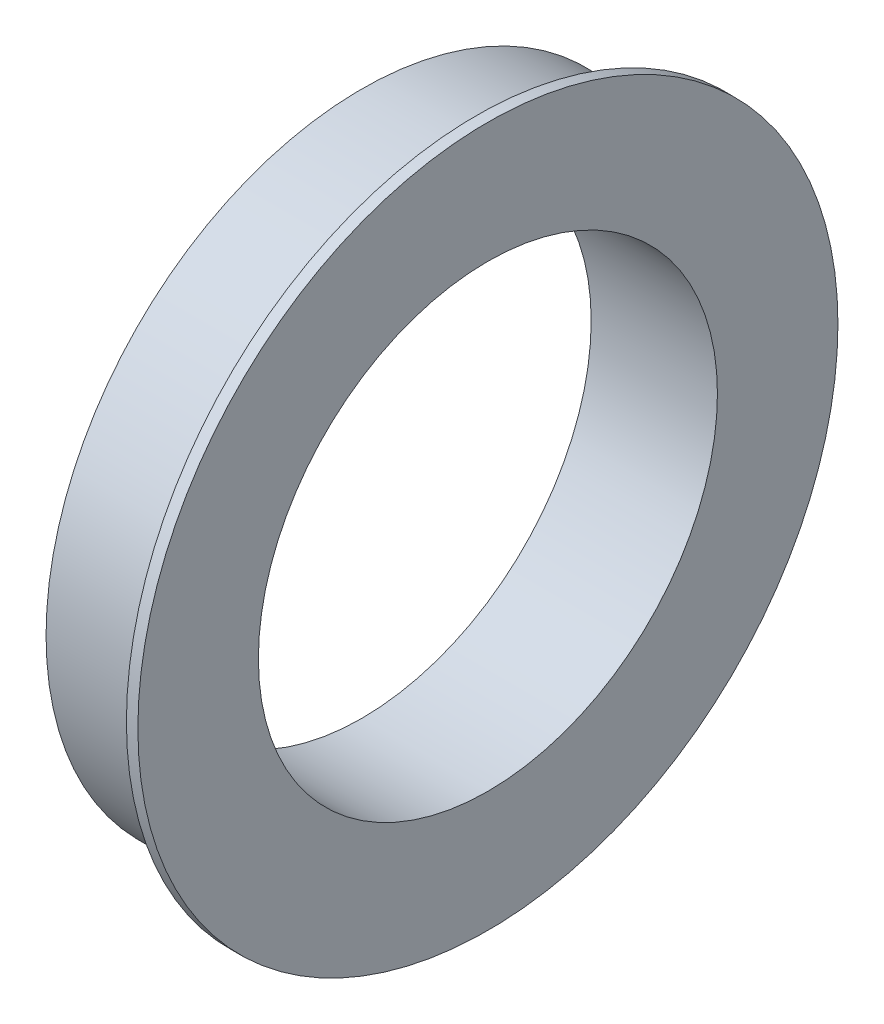
ISO-10303-21;
HEADER;
FILE_DESCRIPTION(('STEP AP214'),'2;1');
FILE_NAME('part.step','',(''),(''),'','','');
FILE_SCHEMA(('AUTOMOTIVE_DESIGN { 1 0 10303 214 1 1 1 1 }'));
ENDSEC;
DATA;
#1=APPLICATION_CONTEXT('core data for automotive mechanical design processes');
#2=APPLICATION_PROTOCOL_DEFINITION('international standard','automotive_design',2000,#1);
#3=PRODUCT_CONTEXT('',#1,'mechanical');
#4=PRODUCT('Part','Part','',(#3));
#5=PRODUCT_RELATED_PRODUCT_CATEGORY('part','',(#4));
#6=PRODUCT_DEFINITION_FORMATION('','',#4);
#7=PRODUCT_DEFINITION_CONTEXT('part definition',#1,'design');
#8=PRODUCT_DEFINITION('design','',#6,#7);
#9=PRODUCT_DEFINITION_SHAPE('','',#8);
#10=(LENGTH_UNIT() NAMED_UNIT(*) SI_UNIT(.MILLI.,.METRE.));
#11=(NAMED_UNIT(*) PLANE_ANGLE_UNIT() SI_UNIT($,.RADIAN.));
#12=(NAMED_UNIT(*) SI_UNIT($,.STERADIAN.) SOLID_ANGLE_UNIT());
#13=UNCERTAINTY_MEASURE_WITH_UNIT(LENGTH_MEASURE(1.E-05),#10,'distance_accuracy_value','');
#14=(GEOMETRIC_REPRESENTATION_CONTEXT(3) GLOBAL_UNCERTAINTY_ASSIGNED_CONTEXT((#13)) GLOBAL_UNIT_ASSIGNED_CONTEXT((#10,
#11,#12)) REPRESENTATION_CONTEXT('',''));
#15=CARTESIAN_POINT('',(0.,0.,0.));
#16=DIRECTION('',(0.,0.,1.));
#17=DIRECTION('',(1.,0.,0.));
#18=AXIS2_PLACEMENT_3D('',#15,#16,#17);
#19=CARTESIAN_POINT('',(0.,40.,0.));
#20=DIRECTION('',(1.,0.,0.));
#21=DIRECTION('',(0.,0.,-1.));
#22=AXIS2_PLACEMENT_3D('',#19,#20,#21);
#23=PLANE('',#22);
#24=CARTESIAN_POINT('',(0.,0.,0.));
#25=DIRECTION('',(-1.,0.,0.));
#26=DIRECTION('',(0.,0.,1.));
#27=AXIS2_PLACEMENT_3D('',#24,#25,#26);
#28=CIRCLE('',#27,40.);
#29=CARTESIAN_POINT('',(0.,0.,40.));
#30=VERTEX_POINT('',#29);
#31=EDGE_CURVE('E10',#30,#30,#28,.T.);
#32=ORIENTED_EDGE('',*,*,#31,.F.);
#33=EDGE_LOOP('',(#32));
#34=FACE_BOUND('',#33,.T.);
#35=CARTESIAN_POINT('',(0.,0.,0.));
#36=DIRECTION('',(-1.,0.,0.));
#37=DIRECTION('',(0.,0.,1.));
#38=AXIS2_PLACEMENT_3D('',#35,#36,#37);
#39=CIRCLE('',#38,55.);
#40=CARTESIAN_POINT('',(0.,0.,55.));
#41=VERTEX_POINT('',#40);
#42=EDGE_CURVE('E54',#41,#41,#39,.T.);
#43=ORIENTED_EDGE('',*,*,#42,.T.);
#44=EDGE_LOOP('',(#43));
#45=FACE_BOUND('',#44,.T.);
#46=ADVANCED_FACE('F32',(#34,#45),#23,.F.);
#47=CARTESIAN_POINT('',(0.,0.,0.));
#48=DIRECTION('',(-1.,0.,0.));
#49=DIRECTION('',(0.,0.,1.));
#50=AXIS2_PLACEMENT_3D('',#47,#48,#49);
#51=CYLINDRICAL_SURFACE('',#50,40.);
#52=CARTESIAN_POINT('',(22.,0.,0.));
#53=DIRECTION('',(-1.,0.,0.));
#54=DIRECTION('',(0.,0.,1.));
#55=AXIS2_PLACEMENT_3D('',#52,#53,#54);
#56=CIRCLE('',#55,40.);
#57=CARTESIAN_POINT('',(22.,0.,40.));
#58=VERTEX_POINT('',#57);
#59=EDGE_CURVE('E38',#58,#58,#56,.T.);
#60=ORIENTED_EDGE('',*,*,#59,.F.);
#61=EDGE_LOOP('',(#60));
#62=FACE_BOUND('',#61,.T.);
#63=ORIENTED_EDGE('',*,*,#31,.T.);
#64=EDGE_LOOP('',(#63));
#65=FACE_BOUND('',#64,.T.);
#66=ADVANCED_FACE('F79',(#62,#65),#51,.F.);
#67=CARTESIAN_POINT('',(22.,40.,0.));
#68=DIRECTION('',(-1.,0.,0.));
#69=DIRECTION('',(0.,0.,1.));
#70=AXIS2_PLACEMENT_3D('',#67,#68,#69);
#71=PLANE('',#70);
#72=CARTESIAN_POINT('',(22.,0.,0.));
#73=DIRECTION('',(-1.,0.,0.));
#74=DIRECTION('',(0.,0.,1.));
#75=AXIS2_PLACEMENT_3D('',#72,#73,#74);
#76=CIRCLE('',#75,61.);
#77=CARTESIAN_POINT('',(22.,0.,61.));
#78=VERTEX_POINT('',#77);
#79=EDGE_CURVE('E42',#78,#78,#76,.T.);
#80=ORIENTED_EDGE('',*,*,#79,.F.);
#81=EDGE_LOOP('',(#80));
#82=FACE_BOUND('',#81,.T.);
#83=ORIENTED_EDGE('',*,*,#59,.T.);
#84=EDGE_LOOP('',(#83));
#85=FACE_BOUND('',#84,.T.);
#86=ADVANCED_FACE('F74',(#82,#85),#71,.F.);
#87=CARTESIAN_POINT('',(0.,0.,0.));
#88=DIRECTION('',(-1.,0.,0.));
#89=DIRECTION('',(0.,0.,1.));
#90=AXIS2_PLACEMENT_3D('',#87,#88,#89);
#91=CYLINDRICAL_SURFACE('',#90,61.);
#92=CARTESIAN_POINT('',(20.,0.,0.));
#93=DIRECTION('',(-1.,0.,0.));
#94=DIRECTION('',(0.,0.,1.));
#95=AXIS2_PLACEMENT_3D('',#92,#93,#94);
#96=CIRCLE('',#95,61.);
#97=CARTESIAN_POINT('',(20.,0.,61.));
#98=VERTEX_POINT('',#97);
#99=EDGE_CURVE('E46',#98,#98,#96,.T.);
#100=ORIENTED_EDGE('',*,*,#99,.F.);
#101=EDGE_LOOP('',(#100));
#102=FACE_BOUND('',#101,.T.);
#103=ORIENTED_EDGE('',*,*,#79,.T.);
#104=EDGE_LOOP('',(#103));
#105=FACE_BOUND('',#104,.T.);
#106=ADVANCED_FACE('F68',(#102,#105),#91,.T.);
#107=CARTESIAN_POINT('',(20.,61.,0.));
#108=DIRECTION('',(1.,0.,0.));
#109=DIRECTION('',(0.,0.,-1.));
#110=AXIS2_PLACEMENT_3D('',#107,#108,#109);
#111=PLANE('',#110);
#112=CARTESIAN_POINT('',(20.,0.,0.));
#113=DIRECTION('',(-1.,0.,0.));
#114=DIRECTION('',(0.,0.,1.));
#115=AXIS2_PLACEMENT_3D('',#112,#113,#114);
#116=CIRCLE('',#115,55.);
#117=CARTESIAN_POINT('',(20.,0.,55.));
#118=VERTEX_POINT('',#117);
#119=EDGE_CURVE('E51',#118,#118,#116,.T.);
#120=ORIENTED_EDGE('',*,*,#119,.F.);
#121=EDGE_LOOP('',(#120));
#122=FACE_BOUND('',#121,.T.);
#123=ORIENTED_EDGE('',*,*,#99,.T.);
#124=EDGE_LOOP('',(#123));
#125=FACE_BOUND('',#124,.T.);
#126=ADVANCED_FACE('F62',(#122,#125),#111,.F.);
#127=CARTESIAN_POINT('',(0.,0.,0.));
#128=DIRECTION('',(-1.,0.,0.));
#129=DIRECTION('',(0.,0.,1.));
#130=AXIS2_PLACEMENT_3D('',#127,#128,#129);
#131=CYLINDRICAL_SURFACE('',#130,55.);
#132=ORIENTED_EDGE('',*,*,#42,.F.);
#133=EDGE_LOOP('',(#132));
#134=FACE_BOUND('',#133,.T.);
#135=ORIENTED_EDGE('',*,*,#119,.T.);
#136=EDGE_LOOP('',(#135));
#137=FACE_BOUND('',#136,.T.);
#138=ADVANCED_FACE('F59',(#134,#137),#131,.T.);
#139=CLOSED_SHELL('',(#46,#66,#86,#106,#126,#138));
#140=MANIFOLD_SOLID_BREP('B2',#139);
#141=ADVANCED_BREP_SHAPE_REPRESENTATION('',(#18,#140),#14);
#142=SHAPE_DEFINITION_REPRESENTATION(#9,#141);
ENDSEC;
END-ISO-10303-21;
